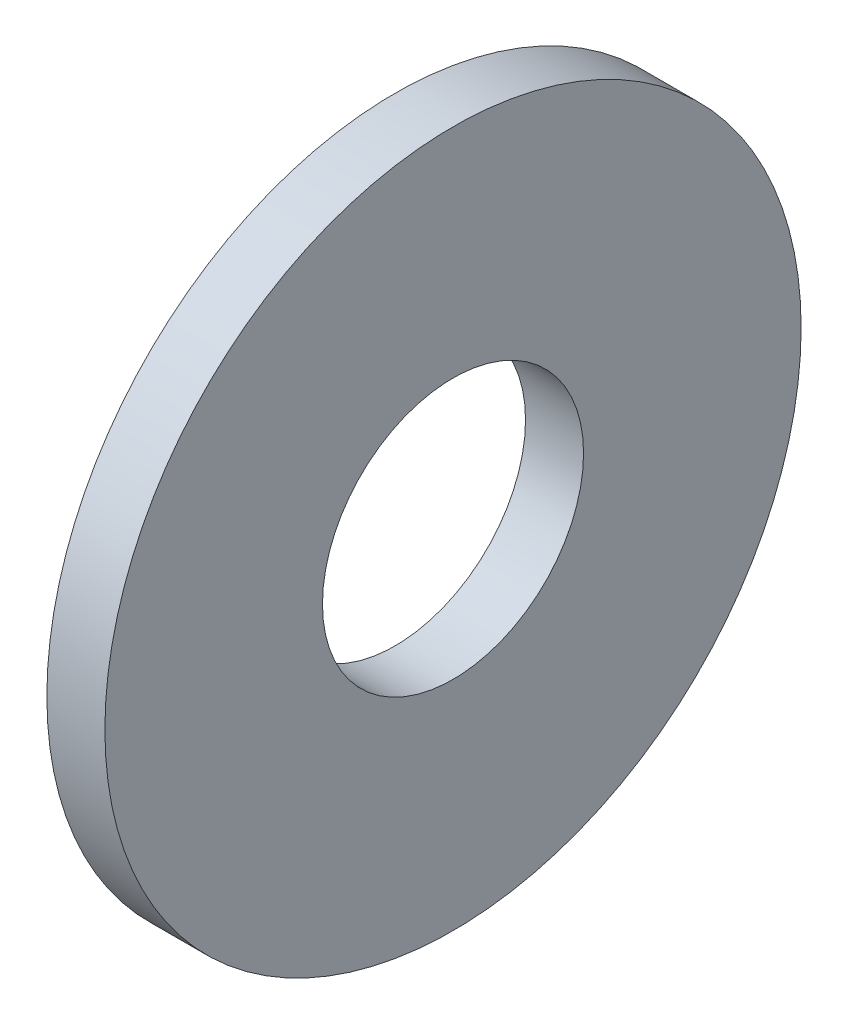
ISO-10303-21;
HEADER;
FILE_DESCRIPTION(('STEP AP214'),'2;1');
FILE_NAME('part.step','',(''),(''),'','','');
FILE_SCHEMA(('AUTOMOTIVE_DESIGN { 1 0 10303 214 1 1 1 1 }'));
ENDSEC;
DATA;
#1=APPLICATION_CONTEXT('core data for automotive mechanical design processes');
#2=APPLICATION_PROTOCOL_DEFINITION('international standard','automotive_design',2000,#1);
#3=PRODUCT_CONTEXT('',#1,'mechanical');
#4=PRODUCT('Part','Part','',(#3));
#5=PRODUCT_RELATED_PRODUCT_CATEGORY('part','',(#4));
#6=PRODUCT_DEFINITION_FORMATION('','',#4);
#7=PRODUCT_DEFINITION_CONTEXT('part definition',#1,'design');
#8=PRODUCT_DEFINITION('design','',#6,#7);
#9=PRODUCT_DEFINITION_SHAPE('','',#8);
#10=(LENGTH_UNIT() NAMED_UNIT(*) SI_UNIT(.MILLI.,.METRE.));
#11=(NAMED_UNIT(*) PLANE_ANGLE_UNIT() SI_UNIT($,.RADIAN.));
#12=(NAMED_UNIT(*) SI_UNIT($,.STERADIAN.) SOLID_ANGLE_UNIT());
#13=UNCERTAINTY_MEASURE_WITH_UNIT(LENGTH_MEASURE(1.E-05),#10,'distance_accuracy_value','');
#14=(GEOMETRIC_REPRESENTATION_CONTEXT(3) GLOBAL_UNCERTAINTY_ASSIGNED_CONTEXT((#13)) GLOBAL_UNIT_ASSIGNED_CONTEXT((#10,
#11,#12)) REPRESENTATION_CONTEXT('',''));
#15=CARTESIAN_POINT('',(0.,0.,0.));
#16=DIRECTION('',(0.,0.,1.));
#17=DIRECTION('',(1.,0.,0.));
#18=AXIS2_PLACEMENT_3D('',#15,#16,#17);
#19=CARTESIAN_POINT('',(3.175,0.,0.));
#20=DIRECTION('',(1.,0.,0.));
#21=DIRECTION('',(0.,0.,-1.));
#22=AXIS2_PLACEMENT_3D('',#19,#20,#21);
#23=PLANE('',#22);
#24=CARTESIAN_POINT('',(3.175,0.,0.));
#25=DIRECTION('',(1.,0.,0.));
#26=DIRECTION('',(0.,0.,-1.));
#27=AXIS2_PLACEMENT_3D('',#24,#25,#26);
#28=CIRCLE('',#27,38.1);
#29=CARTESIAN_POINT('',(3.175,0.,-38.1));
#30=VERTEX_POINT('',#29);
#31=EDGE_CURVE('E10',#30,#30,#28,.T.);
#32=ORIENTED_EDGE('',*,*,#31,.T.);
#33=EDGE_LOOP('',(#32));
#34=FACE_BOUND('',#33,.T.);
#35=CARTESIAN_POINT('',(3.175,0.,0.));
#36=DIRECTION('',(1.,0.,0.));
#37=DIRECTION('',(0.,0.,-1.));
#38=AXIS2_PLACEMENT_3D('',#35,#36,#37);
#39=CIRCLE('',#38,14.2875);
#40=CARTESIAN_POINT('',(3.175,0.,-14.2875));
#41=VERTEX_POINT('',#40);
#42=EDGE_CURVE('E42',#41,#41,#39,.T.);
#43=ORIENTED_EDGE('',*,*,#42,.F.);
#44=EDGE_LOOP('',(#43));
#45=FACE_BOUND('',#44,.T.);
#46=ADVANCED_FACE('F31',(#34,#45),#23,.T.);
#47=CARTESIAN_POINT('',(-3.175,0.,0.));
#48=DIRECTION('',(1.,0.,0.));
#49=DIRECTION('',(0.,0.,-1.));
#50=AXIS2_PLACEMENT_3D('',#47,#48,#49);
#51=PLANE('',#50);
#52=CARTESIAN_POINT('',(-3.175,0.,0.));
#53=DIRECTION('',(1.,0.,0.));
#54=DIRECTION('',(0.,0.,-1.));
#55=AXIS2_PLACEMENT_3D('',#52,#53,#54);
#56=CIRCLE('',#55,38.1);
#57=CARTESIAN_POINT('',(-3.175,0.,-38.1));
#58=VERTEX_POINT('',#57);
#59=EDGE_CURVE('E35',#58,#58,#56,.T.);
#60=ORIENTED_EDGE('',*,*,#59,.F.);
#61=EDGE_LOOP('',(#60));
#62=FACE_BOUND('',#61,.T.);
#63=CARTESIAN_POINT('',(-3.175,0.,0.));
#64=DIRECTION('',(1.,0.,0.));
#65=DIRECTION('',(0.,0.,-1.));
#66=AXIS2_PLACEMENT_3D('',#63,#64,#65);
#67=CIRCLE('',#66,14.2875);
#68=CARTESIAN_POINT('',(-3.175,0.,-14.2875));
#69=VERTEX_POINT('',#68);
#70=EDGE_CURVE('E44',#69,#69,#67,.T.);
#71=ORIENTED_EDGE('',*,*,#70,.T.);
#72=EDGE_LOOP('',(#71));
#73=FACE_BOUND('',#72,.T.);
#74=ADVANCED_FACE('F54',(#62,#73),#51,.F.);
#75=CARTESIAN_POINT('',(3.175,0.,0.));
#76=DIRECTION('',(-1.,0.,0.));
#77=DIRECTION('',(0.,0.,1.));
#78=AXIS2_PLACEMENT_3D('',#75,#76,#77);
#79=CYLINDRICAL_SURFACE('',#78,38.1);
#80=ORIENTED_EDGE('',*,*,#31,.F.);
#81=EDGE_LOOP('',(#80));
#82=FACE_BOUND('',#81,.T.);
#83=ORIENTED_EDGE('',*,*,#59,.T.);
#84=EDGE_LOOP('',(#83));
#85=FACE_BOUND('',#84,.T.);
#86=ADVANCED_FACE('F33',(#82,#85),#79,.T.);
#87=CARTESIAN_POINT('',(3.175,0.,0.));
#88=DIRECTION('',(-1.,0.,0.));
#89=DIRECTION('',(0.,0.,1.));
#90=AXIS2_PLACEMENT_3D('',#87,#88,#89);
#91=CYLINDRICAL_SURFACE('',#90,14.2875);
#92=ORIENTED_EDGE('',*,*,#42,.T.);
#93=EDGE_LOOP('',(#92));
#94=FACE_BOUND('',#93,.T.);
#95=ORIENTED_EDGE('',*,*,#70,.F.);
#96=EDGE_LOOP('',(#95));
#97=FACE_BOUND('',#96,.T.);
#98=ADVANCED_FACE('F50',(#94,#97),#91,.F.);
#99=CLOSED_SHELL('',(#46,#74,#86,#98));
#100=MANIFOLD_SOLID_BREP('B2',#99);
#101=ADVANCED_BREP_SHAPE_REPRESENTATION('',(#18,#100),#14);
#102=SHAPE_DEFINITION_REPRESENTATION(#9,#101);
ENDSEC;
END-ISO-10303-21;
